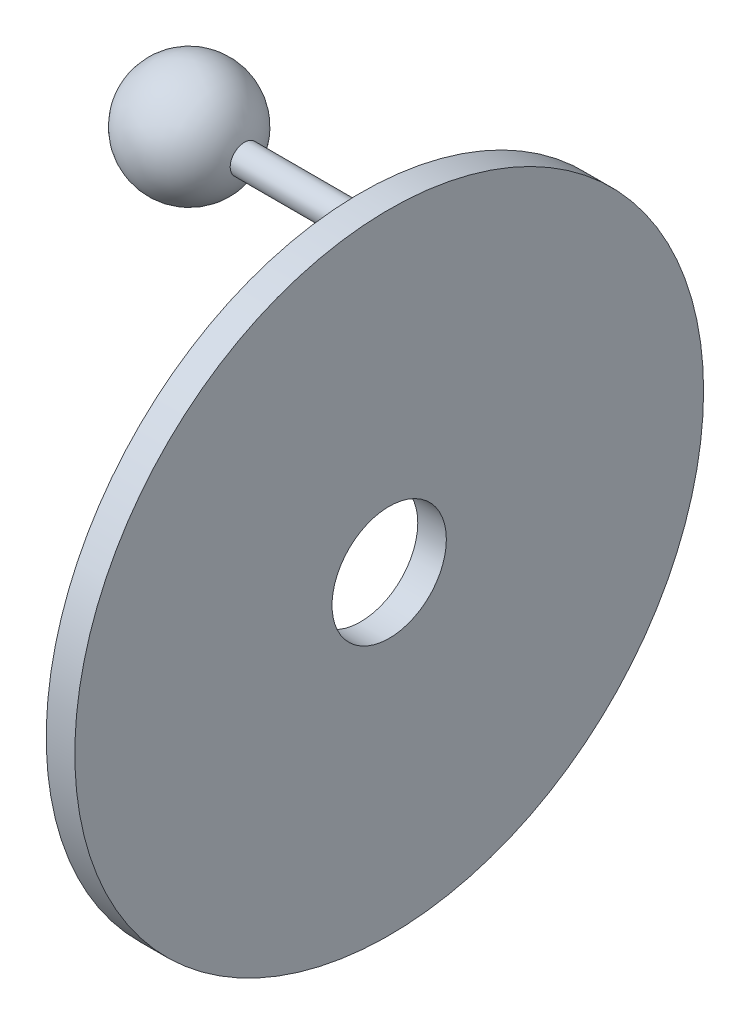
ISO-10303-21;
HEADER;
FILE_DESCRIPTION(('STEP AP214'),'2;1');
FILE_NAME('part.step','',(''),(''),'','','');
FILE_SCHEMA(('AUTOMOTIVE_DESIGN { 1 0 10303 214 1 1 1 1 }'));
ENDSEC;
DATA;
#1=APPLICATION_CONTEXT('core data for automotive mechanical design processes');
#2=APPLICATION_PROTOCOL_DEFINITION('international standard','automotive_design',2000,#1);
#3=PRODUCT_CONTEXT('',#1,'mechanical');
#4=PRODUCT('Part','Part','',(#3));
#5=PRODUCT_RELATED_PRODUCT_CATEGORY('part','',(#4));
#6=PRODUCT_DEFINITION_FORMATION('','',#4);
#7=PRODUCT_DEFINITION_CONTEXT('part definition',#1,'design');
#8=PRODUCT_DEFINITION('design','',#6,#7);
#9=PRODUCT_DEFINITION_SHAPE('','',#8);
#10=(LENGTH_UNIT() NAMED_UNIT(*) SI_UNIT(.MILLI.,.METRE.));
#11=(NAMED_UNIT(*) PLANE_ANGLE_UNIT() SI_UNIT($,.RADIAN.));
#12=(NAMED_UNIT(*) SI_UNIT($,.STERADIAN.) SOLID_ANGLE_UNIT());
#13=UNCERTAINTY_MEASURE_WITH_UNIT(LENGTH_MEASURE(1.E-05),#10,'distance_accuracy_value','');
#14=(GEOMETRIC_REPRESENTATION_CONTEXT(3) GLOBAL_UNCERTAINTY_ASSIGNED_CONTEXT((#13)) GLOBAL_UNIT_ASSIGNED_CONTEXT((#10,
#11,#12)) REPRESENTATION_CONTEXT('',''));
#15=CARTESIAN_POINT('',(0.,0.,0.));
#16=DIRECTION('',(0.,0.,1.));
#17=DIRECTION('',(1.,0.,0.));
#18=AXIS2_PLACEMENT_3D('',#15,#16,#17);
#19=CARTESIAN_POINT('',(0.,0.,0.));
#20=DIRECTION('',(0.,1.,0.));
#21=DIRECTION('',(1.,0.,0.));
#22=AXIS2_PLACEMENT_3D('',#19,#20,#21);
#23=SPHERICAL_SURFACE('',#22,10.);
#24=CARTESIAN_POINT('',(0.,0.,0.));
#25=DIRECTION('',(-1.,0.,0.));
#26=DIRECTION('',(0.,0.,1.));
#27=AXIS2_PLACEMENT_3D('',#24,#25,#26);
#28=SPHERICAL_SURFACE('',#27,10.);
#29=CARTESIAN_POINT('',(9.68245836551854,0.,0.));
#30=DIRECTION('',(-1.,0.,0.));
#31=DIRECTION('',(0.,0.,1.));
#32=AXIS2_PLACEMENT_3D('',#29,#30,#31);
#33=CIRCLE('',#32,2.5);
#34=CARTESIAN_POINT('',(9.68245836551854,0.,2.5));
#35=VERTEX_POINT('',#34);
#36=EDGE_CURVE('E10',#35,#35,#33,.F.);
#37=ORIENTED_EDGE('',*,*,#36,.F.);
#38=EDGE_LOOP('',(#37));
#39=FACE_BOUND('',#38,.T.);
#40=ADVANCED_FACE('F17',(#39),#28,.T.);
#41=CARTESIAN_POINT('',(0.,0.,0.));
#42=DIRECTION('',(-1.,0.,0.));
#43=DIRECTION('',(0.,0.,1.));
#44=AXIS2_PLACEMENT_3D('',#41,#42,#43);
#45=CYLINDRICAL_SURFACE('',#44,2.5);
#46=CARTESIAN_POINT('',(30.,0.,0.));
#47=DIRECTION('',(1.,0.,0.));
#48=DIRECTION('',(0.,0.,-1.));
#49=AXIS2_PLACEMENT_3D('',#46,#47,#48);
#50=CIRCLE('',#49,2.5);
#51=CARTESIAN_POINT('',(30.,0.,-2.5));
#52=VERTEX_POINT('',#51);
#53=EDGE_CURVE('E23',#52,#52,#50,.T.);
#54=ORIENTED_EDGE('',*,*,#53,.F.);
#55=EDGE_LOOP('',(#54));
#56=FACE_BOUND('',#55,.T.);
#57=ORIENTED_EDGE('',*,*,#36,.T.);
#58=EDGE_LOOP('',(#57));
#59=FACE_BOUND('',#58,.T.);
#60=ADVANCED_FACE('F59',(#56,#59),#45,.T.);
#61=CARTESIAN_POINT('',(30.,-50.,0.));
#62=DIRECTION('',(1.,0.,0.));
#63=DIRECTION('',(0.,0.,-1.));
#64=AXIS2_PLACEMENT_3D('',#61,#62,#63);
#65=PLANE('',#64);
#66=CARTESIAN_POINT('',(30.,-50.,0.));
#67=DIRECTION('',(1.,0.,0.));
#68=DIRECTION('',(0.,0.,-1.));
#69=AXIS2_PLACEMENT_3D('',#66,#67,#68);
#70=CIRCLE('',#69,10.);
#71=CARTESIAN_POINT('',(30.,-50.,-10.));
#72=VERTEX_POINT('',#71);
#73=EDGE_CURVE('E37',#72,#72,#70,.T.);
#74=ORIENTED_EDGE('',*,*,#73,.T.);
#75=EDGE_LOOP('',(#74));
#76=FACE_BOUND('',#75,.T.);
#77=CARTESIAN_POINT('',(30.,-50.,0.));
#78=DIRECTION('',(1.,0.,0.));
#79=DIRECTION('',(0.,0.,-1.));
#80=AXIS2_PLACEMENT_3D('',#77,#78,#79);
#81=CIRCLE('',#80,55.);
#82=CARTESIAN_POINT('',(30.,-50.,-55.));
#83=VERTEX_POINT('',#82);
#84=EDGE_CURVE('E31',#83,#83,#81,.T.);
#85=ORIENTED_EDGE('',*,*,#84,.F.);
#86=EDGE_LOOP('',(#85));
#87=FACE_BOUND('',#86,.T.);
#88=ORIENTED_EDGE('',*,*,#53,.T.);
#89=EDGE_LOOP('',(#88));
#90=FACE_BOUND('',#89,.T.);
#91=ADVANCED_FACE('F49',(#76,#87,#90),#65,.F.);
#92=CARTESIAN_POINT('',(35.,-50.,0.));
#93=DIRECTION('',(1.,0.,0.));
#94=DIRECTION('',(0.,0.,-1.));
#95=AXIS2_PLACEMENT_3D('',#92,#93,#94);
#96=PLANE('',#95);
#97=CARTESIAN_POINT('',(35.,-50.,0.));
#98=DIRECTION('',(1.,0.,0.));
#99=DIRECTION('',(0.,0.,-1.));
#100=AXIS2_PLACEMENT_3D('',#97,#98,#99);
#101=CIRCLE('',#100,55.);
#102=CARTESIAN_POINT('',(35.,-50.,-55.));
#103=VERTEX_POINT('',#102);
#104=EDGE_CURVE('E27',#103,#103,#101,.T.);
#105=ORIENTED_EDGE('',*,*,#104,.T.);
#106=EDGE_LOOP('',(#105));
#107=FACE_BOUND('',#106,.T.);
#108=CARTESIAN_POINT('',(35.,-50.,0.));
#109=DIRECTION('',(1.,0.,0.));
#110=DIRECTION('',(0.,0.,-1.));
#111=AXIS2_PLACEMENT_3D('',#108,#109,#110);
#112=CIRCLE('',#111,10.);
#113=CARTESIAN_POINT('',(35.,-50.,-10.));
#114=VERTEX_POINT('',#113);
#115=EDGE_CURVE('E35',#114,#114,#112,.T.);
#116=ORIENTED_EDGE('',*,*,#115,.F.);
#117=EDGE_LOOP('',(#116));
#118=FACE_BOUND('',#117,.T.);
#119=ADVANCED_FACE('F46',(#107,#118),#96,.T.);
#120=CARTESIAN_POINT('',(35.,-50.,0.));
#121=DIRECTION('',(-1.,0.,0.));
#122=DIRECTION('',(0.,0.,1.));
#123=AXIS2_PLACEMENT_3D('',#120,#121,#122);
#124=CYLINDRICAL_SURFACE('',#123,55.);
#125=ORIENTED_EDGE('',*,*,#104,.F.);
#126=EDGE_LOOP('',(#125));
#127=FACE_BOUND('',#126,.T.);
#128=ORIENTED_EDGE('',*,*,#84,.T.);
#129=EDGE_LOOP('',(#128));
#130=FACE_BOUND('',#129,.T.);
#131=ADVANCED_FACE('F48',(#127,#130),#124,.T.);
#132=CARTESIAN_POINT('',(35.,-50.,0.));
#133=DIRECTION('',(-1.,0.,0.));
#134=DIRECTION('',(0.,0.,1.));
#135=AXIS2_PLACEMENT_3D('',#132,#133,#134);
#136=CYLINDRICAL_SURFACE('',#135,10.);
#137=ORIENTED_EDGE('',*,*,#115,.T.);
#138=EDGE_LOOP('',(#137));
#139=FACE_BOUND('',#138,.T.);
#140=ORIENTED_EDGE('',*,*,#73,.F.);
#141=EDGE_LOOP('',(#140));
#142=FACE_BOUND('',#141,.T.);
#143=ADVANCED_FACE('F43',(#139,#142),#136,.F.);
#144=CLOSED_SHELL('',(#40,#60,#91,#119,#131,#143));
#145=MANIFOLD_SOLID_BREP('B1',#144);
#146=ADVANCED_BREP_SHAPE_REPRESENTATION('',(#18,#145),#14);
#147=SHAPE_DEFINITION_REPRESENTATION(#9,#146);
ENDSEC;
END-ISO-10303-21;
